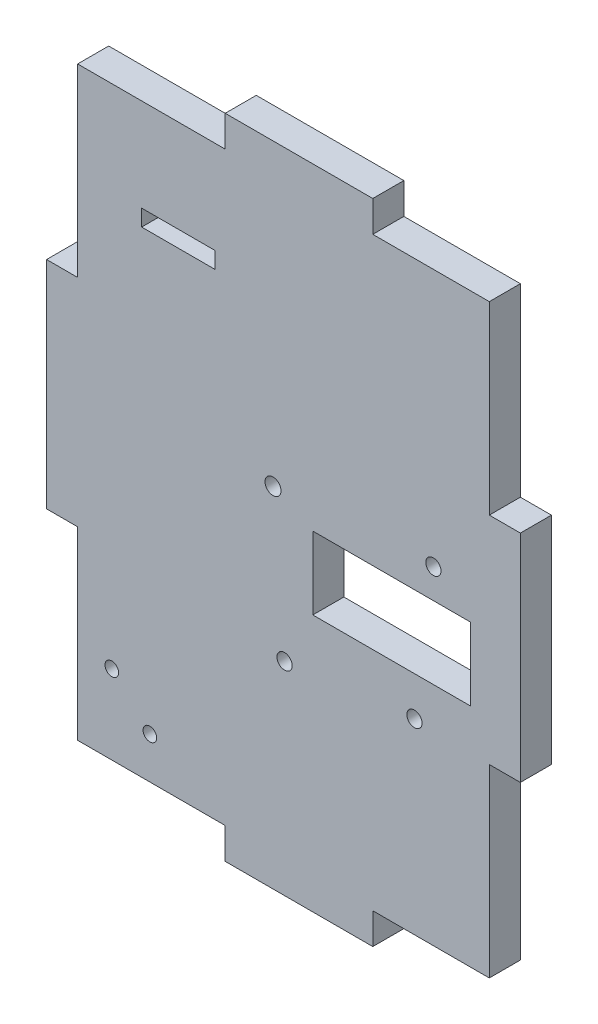
ISO-10303-21;
HEADER;
FILE_DESCRIPTION(('STEP AP214'),'2;1');
FILE_NAME('part.step','',(''),(''),'','','');
FILE_SCHEMA(('AUTOMOTIVE_DESIGN { 1 0 10303 214 1 1 1 1 }'));
ENDSEC;
DATA;
#1=APPLICATION_CONTEXT('core data for automotive mechanical design processes');
#2=APPLICATION_PROTOCOL_DEFINITION('international standard','automotive_design',2000,#1);
#3=PRODUCT_CONTEXT('',#1,'mechanical');
#4=PRODUCT('Part','Part','',(#3));
#5=PRODUCT_RELATED_PRODUCT_CATEGORY('part','',(#4));
#6=PRODUCT_DEFINITION_FORMATION('','',#4);
#7=PRODUCT_DEFINITION_CONTEXT('part definition',#1,'design');
#8=PRODUCT_DEFINITION('design','',#6,#7);
#9=PRODUCT_DEFINITION_SHAPE('','',#8);
#10=(LENGTH_UNIT() NAMED_UNIT(*) SI_UNIT(.MILLI.,.METRE.));
#11=(NAMED_UNIT(*) PLANE_ANGLE_UNIT() SI_UNIT($,.RADIAN.));
#12=(NAMED_UNIT(*) SI_UNIT($,.STERADIAN.) SOLID_ANGLE_UNIT());
#13=UNCERTAINTY_MEASURE_WITH_UNIT(LENGTH_MEASURE(1.E-05),#10,'distance_accuracy_value','');
#14=(GEOMETRIC_REPRESENTATION_CONTEXT(3) GLOBAL_UNCERTAINTY_ASSIGNED_CONTEXT((#13)) GLOBAL_UNIT_ASSIGNED_CONTEXT((#10,
#11,#12)) REPRESENTATION_CONTEXT('',''));
#15=CARTESIAN_POINT('',(0.,0.,0.));
#16=DIRECTION('',(0.,0.,1.));
#17=DIRECTION('',(1.,0.,0.));
#18=AXIS2_PLACEMENT_3D('',#15,#16,#17);
#19=CARTESIAN_POINT('',(0.,0.,5.7912));
#20=DIRECTION('',(0.,0.,-1.));
#21=DIRECTION('',(-1.,0.,0.));
#22=AXIS2_PLACEMENT_3D('',#19,#20,#21);
#23=PLANE('',#22);
#24=DIRECTION('',(1.,0.,0.));
#25=VECTOR('',#24,1.);
#26=CARTESIAN_POINT('',(-26.4395091638221,34.2389804626393,5.7912));
#27=LINE('',#26,#25);
#28=CARTESIAN_POINT('',(-26.4395091638221,34.2389804626393,5.7912));
#29=VERTEX_POINT('',#28);
#30=CARTESIAN_POINT('',(-12.7682869597336,34.2389804626393,5.7912));
#31=VERTEX_POINT('',#30);
#32=EDGE_CURVE('E231',#29,#31,#27,.T.);
#33=ORIENTED_EDGE('',*,*,#32,.F.);
#34=DIRECTION('',(0.,-1.,0.));
#35=VECTOR('',#34,1.);
#36=CARTESIAN_POINT('',(-26.4395091638221,34.2389804626393,5.7912));
#37=LINE('',#36,#35);
#38=CARTESIAN_POINT('',(-26.4395091638221,37.2992746155063,5.7912));
#39=VERTEX_POINT('',#38);
#40=EDGE_CURVE('E50',#39,#29,#37,.T.);
#41=ORIENTED_EDGE('',*,*,#40,.F.);
#42=DIRECTION('',(-1.,0.,0.));
#43=VECTOR('',#42,1.);
#44=CARTESIAN_POINT('',(-26.4395091638221,37.2992746155063,5.7912));
#45=LINE('',#44,#43);
#46=CARTESIAN_POINT('',(-12.7682869597336,37.2992746155063,5.7912));
#47=VERTEX_POINT('',#46);
#48=EDGE_CURVE('E237',#47,#39,#45,.T.);
#49=ORIENTED_EDGE('',*,*,#48,.F.);
#50=DIRECTION('',(0.,1.,0.));
#51=VECTOR('',#50,1.);
#52=CARTESIAN_POINT('',(-12.7682869597336,34.2389804626393,5.7912));
#53=LINE('',#52,#51);
#54=EDGE_CURVE('E222',#31,#47,#53,.T.);
#55=ORIENTED_EDGE('',*,*,#54,.F.);
#56=EDGE_LOOP('',(#33,#41,#49,#55));
#57=FACE_BOUND('',#56,.T.);
#58=CARTESIAN_POINT('',(-24.91218752969,-46.860591388321,5.7912));
#59=DIRECTION('',(0.,0.,-1.));
#60=DIRECTION('',(-1.,0.,0.));
#61=AXIS2_PLACEMENT_3D('',#58,#59,#60);
#62=CIRCLE('',#61,1.26999999999983);
#63=CARTESIAN_POINT('',(-26.1821875296899,-46.860591388321,5.7912));
#64=VERTEX_POINT('',#63);
#65=EDGE_CURVE('E251',#64,#64,#62,.F.);
#66=ORIENTED_EDGE('',*,*,#65,.F.);
#67=EDGE_LOOP('',(#66));
#68=FACE_BOUND('',#67,.T.);
#69=DIRECTION('',(0.,1.,0.));
#70=VECTOR('',#69,1.);
#71=CARTESIAN_POINT('',(-10.8627333333334,54.6099499999999,5.7912000000002));
#72=LINE('',#71,#70);
#73=CARTESIAN_POINT('',(-10.8627333333334,54.6099999999999,5.7912000000002));
#74=VERTEX_POINT('',#73);
#75=CARTESIAN_POINT('',(-10.8627333333334,60.4011999999999,5.7912000000002));
#76=VERTEX_POINT('',#75);
#77=EDGE_CURVE('E260',#74,#76,#72,.T.);
#78=ORIENTED_EDGE('',*,*,#77,.F.);
#79=DIRECTION('',(-1.,0.,0.));
#80=VECTOR('',#79,1.);
#81=CARTESIAN_POINT('',(0.,54.6099999999999,5.7912));
#82=LINE('',#81,#80);
#83=CARTESIAN_POINT('',(-38.3793999999997,54.6099999999999,5.79120000000019));
#84=VERTEX_POINT('',#83);
#85=EDGE_CURVE('E364',#74,#84,#82,.T.);
#86=ORIENTED_EDGE('',*,*,#85,.T.);
#87=DIRECTION('',(0.,1.,0.));
#88=VECTOR('',#87,1.);
#89=CARTESIAN_POINT('',(-38.3794,-60.4012,5.7912));
#90=LINE('',#89,#88);
#91=CARTESIAN_POINT('',(-38.3794000000001,20.1337333333334,5.79120000000013));
#92=VERTEX_POINT('',#91);
#93=EDGE_CURVE('E354',#92,#84,#90,.T.);
#94=ORIENTED_EDGE('',*,*,#93,.F.);
#95=DIRECTION('',(1.,0.,0.));
#96=VECTOR('',#95,1.);
#97=CARTESIAN_POINT('',(-44.1706000000001,20.1337333333333,5.79120000000013));
#98=LINE('',#97,#96);
#99=CARTESIAN_POINT('',(-44.1706000000001,20.1337333333333,5.79120000000013));
#100=VERTEX_POINT('',#99);
#101=EDGE_CURVE('E351',#100,#92,#98,.T.);
#102=ORIENTED_EDGE('',*,*,#101,.F.);
#103=DIRECTION('',(0.,-1.,0.));
#104=VECTOR('',#103,1.);
#105=CARTESIAN_POINT('',(-44.1706,-60.4012,5.7912));
#106=LINE('',#105,#104);
#107=CARTESIAN_POINT('',(-44.1706000000001,-20.1337333333333,5.79120000000007));
#108=VERTEX_POINT('',#107);
#109=EDGE_CURVE('E438',#100,#108,#106,.T.);
#110=ORIENTED_EDGE('',*,*,#109,.T.);
#111=DIRECTION('',(1.,0.,0.));
#112=VECTOR('',#111,1.);
#113=CARTESIAN_POINT('',(-44.1706000000001,-20.1337333333333,5.79120000000007));
#114=LINE('',#113,#112);
#115=CARTESIAN_POINT('',(-38.3794000000001,-20.1337333333333,5.79120000000007));
#116=VERTEX_POINT('',#115);
#117=EDGE_CURVE('E347',#108,#116,#114,.T.);
#118=ORIENTED_EDGE('',*,*,#117,.T.);
#119=CARTESIAN_POINT('',(-38.3794,-54.610000000001,5.79120000000001));
#120=VERTEX_POINT('',#119);
#121=EDGE_CURVE('E362',#120,#116,#90,.T.);
#122=ORIENTED_EDGE('',*,*,#121,.F.);
#123=DIRECTION('',(-1.,0.,0.));
#124=VECTOR('',#123,1.);
#125=CARTESIAN_POINT('',(0.,-54.6100000000001,5.7912));
#126=LINE('',#125,#124);
#127=CARTESIAN_POINT('',(-10.8627333333335,-54.6100000000001,5.79120000000177));
#128=VERTEX_POINT('',#127);
#129=EDGE_CURVE('E371',#128,#120,#126,.T.);
#130=ORIENTED_EDGE('',*,*,#129,.F.);
#131=DIRECTION('',(0.,1.,0.));
#132=VECTOR('',#131,1.);
#133=CARTESIAN_POINT('',(-10.8627333333335,-60.4012000000001,5.79120000000177));
#134=LINE('',#133,#132);
#135=CARTESIAN_POINT('',(-10.8627333333335,-60.4012000000001,5.79120000000177));
#136=VERTEX_POINT('',#135);
#137=EDGE_CURVE('E320',#136,#128,#134,.T.);
#138=ORIENTED_EDGE('',*,*,#137,.F.);
#139=DIRECTION('',(1.,0.,0.));
#140=VECTOR('',#139,1.);
#141=CARTESIAN_POINT('',(-44.1706,-60.4012,5.7912));
#142=LINE('',#141,#140);
#143=CARTESIAN_POINT('',(16.6539333333331,-60.4012000000001,5.79120000000174));
#144=VERTEX_POINT('',#143);
#145=EDGE_CURVE('E441',#136,#144,#142,.T.);
#146=ORIENTED_EDGE('',*,*,#145,.T.);
#147=DIRECTION('',(0.,1.,0.));
#148=VECTOR('',#147,1.);
#149=CARTESIAN_POINT('',(16.6539333333331,-60.4012000000001,5.79120000000174));
#150=LINE('',#149,#148);
#151=CARTESIAN_POINT('',(16.6539333333331,-54.6100000000001,5.79120000000175));
#152=VERTEX_POINT('',#151);
#153=EDGE_CURVE('E331',#144,#152,#150,.T.);
#154=ORIENTED_EDGE('',*,*,#153,.T.);
#155=CARTESIAN_POINT('',(38.3793999999998,-54.6100000000001,5.7912));
#156=VERTEX_POINT('',#155);
#157=EDGE_CURVE('E373',#156,#152,#126,.T.);
#158=ORIENTED_EDGE('',*,*,#157,.F.);
#159=DIRECTION('',(0.,-1.,0.));
#160=VECTOR('',#159,1.);
#161=CARTESIAN_POINT('',(38.3793999999999,0.,5.7912));
#162=LINE('',#161,#160);
#163=CARTESIAN_POINT('',(38.3793999999998,-20.1337333333336,5.7912));
#164=VERTEX_POINT('',#163);
#165=EDGE_CURVE('E368',#164,#156,#162,.T.);
#166=ORIENTED_EDGE('',*,*,#165,.F.);
#167=DIRECTION('',(1.,0.,0.));
#168=VECTOR('',#167,1.);
#169=CARTESIAN_POINT('',(38.3793999999998,-20.1337333333336,5.7912));
#170=LINE('',#169,#168);
#171=CARTESIAN_POINT('',(44.1705999999999,-20.1337333333336,5.7912));
#172=VERTEX_POINT('',#171);
#173=EDGE_CURVE('E299',#164,#172,#170,.T.);
#174=ORIENTED_EDGE('',*,*,#173,.T.);
#175=DIRECTION('',(0.,1.,0.));
#176=VECTOR('',#175,1.);
#177=CARTESIAN_POINT('',(44.1706,-60.4012,5.7912));
#178=LINE('',#177,#176);
#179=CARTESIAN_POINT('',(44.1705999999999,20.1337333333331,5.7912000000001));
#180=VERTEX_POINT('',#179);
#181=EDGE_CURVE('E431',#172,#180,#178,.T.);
#182=ORIENTED_EDGE('',*,*,#181,.T.);
#183=DIRECTION('',(1.,0.,0.));
#184=VECTOR('',#183,1.);
#185=CARTESIAN_POINT('',(38.3793999999998,20.1337333333331,5.7912000000001));
#186=LINE('',#185,#184);
#187=CARTESIAN_POINT('',(38.3793999999998,20.1337333333331,5.7912000000001));
#188=VERTEX_POINT('',#187);
#189=EDGE_CURVE('E302',#188,#180,#186,.T.);
#190=ORIENTED_EDGE('',*,*,#189,.F.);
#191=CARTESIAN_POINT('',(38.3793999999999,54.6099999999998,5.7912));
#192=VERTEX_POINT('',#191);
#193=EDGE_CURVE('E370',#192,#188,#162,.T.);
#194=ORIENTED_EDGE('',*,*,#193,.F.);
#195=CARTESIAN_POINT('',(16.6539333333333,54.6099999999999,5.7912000000002));
#196=VERTEX_POINT('',#195);
#197=EDGE_CURVE('E367',#192,#196,#82,.T.);
#198=ORIENTED_EDGE('',*,*,#197,.T.);
#199=DIRECTION('',(0.,1.,0.));
#200=VECTOR('',#199,1.);
#201=CARTESIAN_POINT('',(16.6539333333333,54.6099499999999,5.7912000000002));
#202=LINE('',#201,#200);
#203=CARTESIAN_POINT('',(16.6539333333333,60.4011999999999,5.7912000000002));
#204=VERTEX_POINT('',#203);
#205=EDGE_CURVE('E261',#196,#204,#202,.T.);
#206=ORIENTED_EDGE('',*,*,#205,.T.);
#207=DIRECTION('',(-1.,0.,0.));
#208=VECTOR('',#207,1.);
#209=CARTESIAN_POINT('',(-44.1706,60.4012,5.7912));
#210=LINE('',#209,#208);
#211=EDGE_CURVE('E434',#204,#76,#210,.T.);
#212=ORIENTED_EDGE('',*,*,#211,.T.);
#213=EDGE_LOOP('',(#78,#86,#94,#102,#110,#118,#122,#130,#138,#146,#154,#158,#166,#174,#182,#190,
#194,#198,#206,#212));
#214=FACE_BOUND('',#213,.T.);
#215=DIRECTION('',(-1.,0.,0.));
#216=VECTOR('',#215,1.);
#217=CARTESIAN_POINT('',(5.47144261334685,-12.4393642243081,5.7912));
#218=LINE('',#217,#216);
#219=CARTESIAN_POINT('',(34.8387940352524,-12.4393642243081,5.7912));
#220=VERTEX_POINT('',#219);
#221=CARTESIAN_POINT('',(5.47144261334685,-12.4393642243081,5.7912));
#222=VERTEX_POINT('',#221);
#223=EDGE_CURVE('E384',#220,#222,#218,.T.);
#224=ORIENTED_EDGE('',*,*,#223,.T.);
#225=DIRECTION('',(0.,1.,0.));
#226=VECTOR('',#225,1.);
#227=CARTESIAN_POINT('',(5.47144261334685,1.10549881980404,5.7912));
#228=LINE('',#227,#226);
#229=CARTESIAN_POINT('',(5.47144261334685,1.10549881980404,5.7912));
#230=VERTEX_POINT('',#229);
#231=EDGE_CURVE('E374',#222,#230,#228,.T.);
#232=ORIENTED_EDGE('',*,*,#231,.T.);
#233=DIRECTION('',(1.,0.,0.));
#234=VECTOR('',#233,1.);
#235=CARTESIAN_POINT('',(5.47144261334685,1.10549881980404,5.7912));
#236=LINE('',#235,#234);
#237=CARTESIAN_POINT('',(34.8387940352524,1.10549881980404,5.7912));
#238=VERTEX_POINT('',#237);
#239=EDGE_CURVE('E377',#230,#238,#236,.T.);
#240=ORIENTED_EDGE('',*,*,#239,.T.);
#241=DIRECTION('',(0.,-1.,0.));
#242=VECTOR('',#241,1.);
#243=CARTESIAN_POINT('',(34.8387940352524,1.10549881980404,5.7912));
#244=LINE('',#243,#242);
#245=EDGE_CURVE('E381',#238,#220,#244,.T.);
#246=ORIENTED_EDGE('',*,*,#245,.T.);
#247=EDGE_LOOP('',(#224,#232,#240,#246));
#248=FACE_BOUND('',#247,.T.);
#249=CARTESIAN_POINT('',(27.9536640877018,6.59881508488763,5.7912));
#250=DIRECTION('',(0.,0.,1.));
#251=DIRECTION('',(1.,0.,0.));
#252=AXIS2_PLACEMENT_3D('',#249,#250,#251);
#253=CIRCLE('',#252,1.4224);
#254=CARTESIAN_POINT('',(29.3760640877018,6.59881508488763,5.7912));
#255=VERTEX_POINT('',#254);
#256=EDGE_CURVE('E400',#255,#255,#253,.T.);
#257=ORIENTED_EDGE('',*,*,#256,.F.);
#258=EDGE_LOOP('',(#257));
#259=FACE_BOUND('',#258,.T.);
#260=CARTESIAN_POINT('',(-1.94945011690196,4.63092805129448,5.7912));
#261=DIRECTION('',(0.,0.,1.));
#262=DIRECTION('',(1.,0.,0.));
#263=AXIS2_PLACEMENT_3D('',#260,#261,#262);
#264=CIRCLE('',#263,1.49764105261563);
#265=CARTESIAN_POINT('',(-0.451809064286326,4.63092805129448,5.7912));
#266=VERTEX_POINT('',#265);
#267=EDGE_CURVE('E410',#266,#266,#264,.T.);
#268=ORIENTED_EDGE('',*,*,#267,.F.);
#269=EDGE_LOOP('',(#268));
#270=FACE_BOUND('',#269,.T.);
#271=CARTESIAN_POINT('',(24.4236958284387,-19.7446538690287,5.7912));
#272=DIRECTION('',(0.,0.,1.));
#273=DIRECTION('',(1.,0.,0.));
#274=AXIS2_PLACEMENT_3D('',#271,#272,#273);
#275=CIRCLE('',#274,1.4224);
#276=CARTESIAN_POINT('',(25.8460958284387,-19.7446538690287,5.7912));
#277=VERTEX_POINT('',#276);
#278=EDGE_CURVE('E416',#277,#277,#275,.T.);
#279=ORIENTED_EDGE('',*,*,#278,.F.);
#280=EDGE_LOOP('',(#279));
#281=FACE_BOUND('',#280,.T.);
#282=CARTESIAN_POINT('',(0.203199999999459,-22.5641942190248,5.7912));
#283=DIRECTION('',(0.,0.,1.));
#284=DIRECTION('',(1.,0.,0.));
#285=AXIS2_PLACEMENT_3D('',#282,#283,#284);
#286=CIRCLE('',#285,1.4224);
#287=CARTESIAN_POINT('',(1.62559999999946,-22.5641942190248,5.7912));
#288=VERTEX_POINT('',#287);
#289=EDGE_CURVE('E422',#288,#288,#286,.T.);
#290=ORIENTED_EDGE('',*,*,#289,.F.);
#291=EDGE_LOOP('',(#290));
#292=FACE_BOUND('',#291,.T.);
#293=CARTESIAN_POINT('',(-32.0098826167025,-39.8787828932964,5.7912));
#294=DIRECTION('',(0.,0.,-1.));
#295=DIRECTION('',(-1.,0.,0.));
#296=AXIS2_PLACEMENT_3D('',#293,#294,#295);
#297=CIRCLE('',#296,1.26999999999982);
#298=CARTESIAN_POINT('',(-33.2798826167023,-39.8787828932964,5.7912));
#299=VERTEX_POINT('',#298);
#300=EDGE_CURVE('E247',#299,#299,#297,.F.);
#301=ORIENTED_EDGE('',*,*,#300,.F.);
#302=EDGE_LOOP('',(#301));
#303=FACE_BOUND('',#302,.T.);
#304=ADVANCED_FACE('F35',(#57,#68,#214,#248,#259,#270,#281,#292,#303),#23,.F.);
#305=CARTESIAN_POINT('',(0.,0.,0.));
#306=DIRECTION('',(0.,0.,-1.));
#307=DIRECTION('',(-1.,0.,0.));
#308=AXIS2_PLACEMENT_3D('',#305,#306,#307);
#309=PLANE('',#308);
#310=DIRECTION('',(0.,1.,0.));
#311=VECTOR('',#310,1.);
#312=CARTESIAN_POINT('',(-26.4395091638221,0.,0.));
#313=LINE('',#312,#311);
#314=CARTESIAN_POINT('',(-26.4395091638221,34.2389804626393,0.));
#315=VERTEX_POINT('',#314);
#316=CARTESIAN_POINT('',(-26.4395091638221,37.2992746155063,0.));
#317=VERTEX_POINT('',#316);
#318=EDGE_CURVE('E11',#315,#317,#313,.T.);
#319=ORIENTED_EDGE('',*,*,#318,.F.);
#320=DIRECTION('',(-1.,0.,0.));
#321=VECTOR('',#320,1.);
#322=CARTESIAN_POINT('',(0.,34.2389804626393,0.));
#323=LINE('',#322,#321);
#324=CARTESIAN_POINT('',(-12.7682869597336,34.2389804626393,0.));
#325=VERTEX_POINT('',#324);
#326=EDGE_CURVE('E461',#325,#315,#323,.T.);
#327=ORIENTED_EDGE('',*,*,#326,.F.);
#328=DIRECTION('',(0.,-1.,0.));
#329=VECTOR('',#328,1.);
#330=CARTESIAN_POINT('',(-12.7682869597336,0.,0.));
#331=LINE('',#330,#329);
#332=CARTESIAN_POINT('',(-12.7682869597336,37.2992746155063,0.));
#333=VERTEX_POINT('',#332);
#334=EDGE_CURVE('E225',#333,#325,#331,.T.);
#335=ORIENTED_EDGE('',*,*,#334,.F.);
#336=DIRECTION('',(1.,0.,0.));
#337=VECTOR('',#336,1.);
#338=CARTESIAN_POINT('',(0.,37.2992746155063,0.));
#339=LINE('',#338,#337);
#340=EDGE_CURVE('E43',#317,#333,#339,.T.);
#341=ORIENTED_EDGE('',*,*,#340,.F.);
#342=EDGE_LOOP('',(#319,#327,#335,#341));
#343=FACE_BOUND('',#342,.T.);
#344=CARTESIAN_POINT('',(-24.91218752969,-46.860591388321,0.));
#345=DIRECTION('',(0.,0.,-1.));
#346=DIRECTION('',(-1.,0.,0.));
#347=AXIS2_PLACEMENT_3D('',#344,#345,#346);
#348=CIRCLE('',#347,1.26999999999983);
#349=CARTESIAN_POINT('',(-26.1821875296899,-46.860591388321,0.));
#350=VERTEX_POINT('',#349);
#351=EDGE_CURVE('E250',#350,#350,#348,.F.);
#352=ORIENTED_EDGE('',*,*,#351,.T.);
#353=EDGE_LOOP('',(#352));
#354=FACE_BOUND('',#353,.T.);
#355=DIRECTION('',(1.,0.,0.));
#356=VECTOR('',#355,1.);
#357=CARTESIAN_POINT('',(-44.1706000000001,20.1337333333334,1.33573707650214E-13));
#358=LINE('',#357,#356);
#359=CARTESIAN_POINT('',(-44.1706000000001,20.1337333333334,1.33573707650214E-13));
#360=VERTEX_POINT('',#359);
#361=CARTESIAN_POINT('',(-38.3794000000001,20.1337333333334,1.31838984174237E-13));
#362=VERTEX_POINT('',#361);
#363=EDGE_CURVE('E355',#360,#362,#358,.T.);
#364=ORIENTED_EDGE('',*,*,#363,.T.);
#365=DIRECTION('',(0.,1.,0.));
#366=VECTOR('',#365,1.);
#367=CARTESIAN_POINT('',(-38.3794000000001,0.,0.));
#368=LINE('',#367,#366);
#369=CARTESIAN_POINT('',(-38.3794000000002,54.6099999999999,2.13159420670017E-13));
#370=VERTEX_POINT('',#369);
#371=EDGE_CURVE('E458',#362,#370,#368,.T.);
#372=ORIENTED_EDGE('',*,*,#371,.T.);
#373=DIRECTION('',(-1.,0.,0.));
#374=VECTOR('',#373,1.);
#375=CARTESIAN_POINT('',(44.1705999999999,54.6099999999999,2.0122792321331E-13));
#376=LINE('',#375,#374);
#377=CARTESIAN_POINT('',(-10.8627333333334,54.6099999999999,2.0122792321331E-13));
#378=VERTEX_POINT('',#377);
#379=EDGE_CURVE('E269',#378,#370,#376,.T.);
#380=ORIENTED_EDGE('',*,*,#379,.F.);
#381=DIRECTION('',(0.,1.,0.));
#382=VECTOR('',#381,1.);
#383=CARTESIAN_POINT('',(-10.8627333333334,54.6099999999999,2.08166817117217E-13));
#384=LINE('',#383,#382);
#385=CARTESIAN_POINT('',(-10.8627333333334,60.4012,0.));
#386=VERTEX_POINT('',#385);
#387=EDGE_CURVE('E531',#378,#386,#384,.T.);
#388=ORIENTED_EDGE('',*,*,#387,.T.);
#389=DIRECTION('',(-1.,0.,0.));
#390=VECTOR('',#389,1.);
#391=CARTESIAN_POINT('',(-44.1706,60.4012,0.));
#392=LINE('',#391,#390);
#393=CARTESIAN_POINT('',(16.6539333333333,60.4011999999999,2.15105711021124E-13));
#394=VERTEX_POINT('',#393);
#395=EDGE_CURVE('E447',#394,#386,#392,.T.);
#396=ORIENTED_EDGE('',*,*,#395,.F.);
#397=DIRECTION('',(0.,-1.,0.));
#398=VECTOR('',#397,1.);
#399=CARTESIAN_POINT('',(16.6539333333333,54.6099999999999,2.08166817117217E-13));
#400=LINE('',#399,#398);
#401=CARTESIAN_POINT('',(16.6539333333333,54.6099999999999,0.));
#402=VERTEX_POINT('',#401);
#403=EDGE_CURVE('E279',#394,#402,#400,.T.);
#404=ORIENTED_EDGE('',*,*,#403,.T.);
#405=CARTESIAN_POINT('',(38.3793999999999,54.6099999999998,1.87350135405495E-13));
#406=VERTEX_POINT('',#405);
#407=EDGE_CURVE('E275',#406,#402,#376,.T.);
#408=ORIENTED_EDGE('',*,*,#407,.F.);
#409=DIRECTION('',(0.,-1.,0.));
#410=VECTOR('',#409,1.);
#411=CARTESIAN_POINT('',(38.3793999999998,-60.4012000000002,0.));
#412=LINE('',#411,#410);
#413=CARTESIAN_POINT('',(38.3793999999998,20.1337333333331,1.04083408558608E-13));
#414=VERTEX_POINT('',#413);
#415=EDGE_CURVE('E308',#406,#414,#412,.T.);
#416=ORIENTED_EDGE('',*,*,#415,.T.);
#417=DIRECTION('',(1.,0.,0.));
#418=VECTOR('',#417,1.);
#419=CARTESIAN_POINT('',(38.3793999999998,20.1337333333331,1.04083408558608E-13));
#420=LINE('',#419,#418);
#421=CARTESIAN_POINT('',(44.1705999999999,20.1337333333331,1.04083408558608E-13));
#422=VERTEX_POINT('',#421);
#423=EDGE_CURVE('E289',#414,#422,#420,.T.);
#424=ORIENTED_EDGE('',*,*,#423,.T.);
#425=DIRECTION('',(0.,1.,0.));
#426=VECTOR('',#425,1.);
#427=CARTESIAN_POINT('',(44.1706,-60.4012,0.));
#428=LINE('',#427,#426);
#429=CARTESIAN_POINT('',(44.1705999999999,-20.1337333333336,0.));
#430=VERTEX_POINT('',#429);
#431=EDGE_CURVE('E428',#430,#422,#428,.T.);
#432=ORIENTED_EDGE('',*,*,#431,.F.);
#433=DIRECTION('',(1.,0.,0.));
#434=VECTOR('',#433,1.);
#435=CARTESIAN_POINT('',(38.3793999999998,-20.1337333333336,0.));
#436=LINE('',#435,#434);
#437=CARTESIAN_POINT('',(38.3793999999998,-20.1337333333336,0.));
#438=VERTEX_POINT('',#437);
#439=EDGE_CURVE('E296',#438,#430,#436,.T.);
#440=ORIENTED_EDGE('',*,*,#439,.F.);
#441=CARTESIAN_POINT('',(38.3793999999998,-54.6100000000001,1.73859034177873E-12));
#442=VERTEX_POINT('',#441);
#443=EDGE_CURVE('E307',#438,#442,#412,.T.);
#444=ORIENTED_EDGE('',*,*,#443,.T.);
#445=DIRECTION('',(-1.,0.,0.));
#446=VECTOR('',#445,1.);
#447=CARTESIAN_POINT('',(44.1705999999998,-54.6100000000001,1.73472347597681E-12));
#448=LINE('',#447,#446);
#449=CARTESIAN_POINT('',(16.6539333333331,-54.6100000000001,1.75554015768853E-12));
#450=VERTEX_POINT('',#449);
#451=EDGE_CURVE('E335',#442,#450,#448,.T.);
#452=ORIENTED_EDGE('',*,*,#451,.T.);
#453=DIRECTION('',(0.,1.,0.));
#454=VECTOR('',#453,1.);
#455=CARTESIAN_POINT('',(16.6539333333331,-60.4012000000001,1.74166236988071E-12));
#456=LINE('',#455,#454);
#457=CARTESIAN_POINT('',(16.6539333333331,-60.4012000000001,1.74166236988071E-12));
#458=VERTEX_POINT('',#457);
#459=EDGE_CURVE('E328',#458,#450,#456,.T.);
#460=ORIENTED_EDGE('',*,*,#459,.F.);
#461=DIRECTION('',(1.,0.,0.));
#462=VECTOR('',#461,1.);
#463=CARTESIAN_POINT('',(-44.1706,-60.4012,0.));
#464=LINE('',#463,#462);
#465=CARTESIAN_POINT('',(-10.8627333333335,-60.4012000000001,1.76941794549634E-12));
#466=VERTEX_POINT('',#465);
#467=EDGE_CURVE('E435',#466,#458,#464,.T.);
#468=ORIENTED_EDGE('',*,*,#467,.F.);
#469=DIRECTION('',(0.,1.,0.));
#470=VECTOR('',#469,1.);
#471=CARTESIAN_POINT('',(-10.8627333333335,-60.4012000000001,1.76941794549634E-12));
#472=LINE('',#471,#470);
#473=CARTESIAN_POINT('',(-10.8627333333335,-54.6100000000001,0.));
#474=VERTEX_POINT('',#473);
#475=EDGE_CURVE('E324',#466,#474,#472,.T.);
#476=ORIENTED_EDGE('',*,*,#475,.T.);
#477=CARTESIAN_POINT('',(-38.3794,-54.610000000001,1.78676518025611E-12));
#478=VERTEX_POINT('',#477);
#479=EDGE_CURVE('E327',#474,#478,#448,.T.);
#480=ORIENTED_EDGE('',*,*,#479,.T.);
#481=CARTESIAN_POINT('',(-38.3794000000001,-20.1337333333333,0.));
#482=VERTEX_POINT('',#481);
#483=EDGE_CURVE('E444',#478,#482,#368,.T.);
#484=ORIENTED_EDGE('',*,*,#483,.T.);
#485=DIRECTION('',(1.,0.,0.));
#486=VECTOR('',#485,1.);
#487=CARTESIAN_POINT('',(-44.1706000000001,-20.1337333333333,0.));
#488=LINE('',#487,#486);
#489=CARTESIAN_POINT('',(-44.1706000000001,-20.1337333333333,0.));
#490=VERTEX_POINT('',#489);
#491=EDGE_CURVE('E358',#490,#482,#488,.T.);
#492=ORIENTED_EDGE('',*,*,#491,.F.);
#493=DIRECTION('',(0.,-1.,0.));
#494=VECTOR('',#493,1.);
#495=CARTESIAN_POINT('',(-44.1706,-60.4012,0.));
#496=LINE('',#495,#494);
#497=EDGE_CURVE('E450',#360,#490,#496,.T.);
#498=ORIENTED_EDGE('',*,*,#497,.F.);
#499=EDGE_LOOP('',(#364,#372,#380,#388,#396,#404,#408,#416,#424,#432,#440,#444,#452,#460,#468,
#476,#480,#484,#492,#498));
#500=FACE_BOUND('',#499,.T.);
#501=CARTESIAN_POINT('',(0.203199999999459,-22.5641942190248,0.));
#502=DIRECTION('',(0.,0.,1.));
#503=DIRECTION('',(1.,0.,0.));
#504=AXIS2_PLACEMENT_3D('',#501,#502,#503);
#505=CIRCLE('',#504,1.4224);
#506=CARTESIAN_POINT('',(1.62559999999946,-22.5641942190248,0.));
#507=VERTEX_POINT('',#506);
#508=EDGE_CURVE('E425',#507,#507,#505,.T.);
#509=ORIENTED_EDGE('',*,*,#508,.T.);
#510=EDGE_LOOP('',(#509));
#511=FACE_BOUND('',#510,.T.);
#512=CARTESIAN_POINT('',(24.4236958284387,-19.7446538690287,0.));
#513=DIRECTION('',(0.,0.,1.));
#514=DIRECTION('',(1.,0.,0.));
#515=AXIS2_PLACEMENT_3D('',#512,#513,#514);
#516=CIRCLE('',#515,1.4224);
#517=CARTESIAN_POINT('',(25.8460958284387,-19.7446538690287,0.));
#518=VERTEX_POINT('',#517);
#519=EDGE_CURVE('E419',#518,#518,#516,.T.);
#520=ORIENTED_EDGE('',*,*,#519,.T.);
#521=EDGE_LOOP('',(#520));
#522=FACE_BOUND('',#521,.T.);
#523=CARTESIAN_POINT('',(-1.94945011690196,4.63092805129448,0.));
#524=DIRECTION('',(0.,0.,1.));
#525=DIRECTION('',(1.,0.,0.));
#526=AXIS2_PLACEMENT_3D('',#523,#524,#525);
#527=CIRCLE('',#526,1.49764105261563);
#528=CARTESIAN_POINT('',(-0.451809064286326,4.63092805129448,0.));
#529=VERTEX_POINT('',#528);
#530=EDGE_CURVE('E413',#529,#529,#527,.T.);
#531=ORIENTED_EDGE('',*,*,#530,.T.);
#532=EDGE_LOOP('',(#531));
#533=FACE_BOUND('',#532,.T.);
#534=CARTESIAN_POINT('',(27.9536640877018,6.59881508488763,0.));
#535=DIRECTION('',(0.,0.,1.));
#536=DIRECTION('',(1.,0.,0.));
#537=AXIS2_PLACEMENT_3D('',#534,#535,#536);
#538=CIRCLE('',#537,1.4224);
#539=CARTESIAN_POINT('',(29.3760640877018,6.59881508488763,0.));
#540=VERTEX_POINT('',#539);
#541=EDGE_CURVE('E407',#540,#540,#538,.T.);
#542=ORIENTED_EDGE('',*,*,#541,.T.);
#543=EDGE_LOOP('',(#542));
#544=FACE_BOUND('',#543,.T.);
#545=DIRECTION('',(0.,1.,0.));
#546=VECTOR('',#545,1.);
#547=CARTESIAN_POINT('',(5.47144261334685,1.10549881980404,0.));
#548=LINE('',#547,#546);
#549=CARTESIAN_POINT('',(5.47144261334685,-12.4393642243081,0.));
#550=VERTEX_POINT('',#549);
#551=CARTESIAN_POINT('',(5.47144261334685,1.10549881980404,0.));
#552=VERTEX_POINT('',#551);
#553=EDGE_CURVE('E388',#550,#552,#548,.T.);
#554=ORIENTED_EDGE('',*,*,#553,.F.);
#555=DIRECTION('',(-1.,0.,0.));
#556=VECTOR('',#555,1.);
#557=CARTESIAN_POINT('',(5.47144261334685,-12.4393642243081,0.));
#558=LINE('',#557,#556);
#559=CARTESIAN_POINT('',(34.8387940352524,-12.4393642243081,0.));
#560=VERTEX_POINT('',#559);
#561=EDGE_CURVE('E378',#560,#550,#558,.T.);
#562=ORIENTED_EDGE('',*,*,#561,.F.);
#563=DIRECTION('',(0.,-1.,0.));
#564=VECTOR('',#563,1.);
#565=CARTESIAN_POINT('',(34.8387940352524,1.10549881980404,0.));
#566=LINE('',#565,#564);
#567=CARTESIAN_POINT('',(34.8387940352524,1.10549881980404,0.));
#568=VERTEX_POINT('',#567);
#569=EDGE_CURVE('E393',#568,#560,#566,.T.);
#570=ORIENTED_EDGE('',*,*,#569,.F.);
#571=DIRECTION('',(1.,0.,0.));
#572=VECTOR('',#571,1.);
#573=CARTESIAN_POINT('',(5.47144261334685,1.10549881980404,0.));
#574=LINE('',#573,#572);
#575=EDGE_CURVE('E390',#552,#568,#574,.T.);
#576=ORIENTED_EDGE('',*,*,#575,.F.);
#577=EDGE_LOOP('',(#554,#562,#570,#576));
#578=FACE_BOUND('',#577,.T.);
#579=CARTESIAN_POINT('',(-32.0098826167025,-39.8787828932964,0.));
#580=DIRECTION('',(0.,0.,-1.));
#581=DIRECTION('',(-1.,0.,0.));
#582=AXIS2_PLACEMENT_3D('',#579,#580,#581);
#583=CIRCLE('',#582,1.26999999999982);
#584=CARTESIAN_POINT('',(-33.2798826167023,-39.8787828932964,0.));
#585=VERTEX_POINT('',#584);
#586=EDGE_CURVE('E244',#585,#585,#583,.F.);
#587=ORIENTED_EDGE('',*,*,#586,.T.);
#588=EDGE_LOOP('',(#587));
#589=FACE_BOUND('',#588,.T.);
#590=ADVANCED_FACE('F473',(#343,#354,#500,#511,#522,#533,#544,#578,#589),#309,.T.);
#591=CARTESIAN_POINT('',(44.1706,-60.4012,5.7912));
#592=DIRECTION('',(-1.,0.,0.));
#593=DIRECTION('',(0.,0.,1.));
#594=AXIS2_PLACEMENT_3D('',#591,#592,#593);
#595=PLANE('',#594);
#596=DIRECTION('',(0.,0.,-1.));
#597=VECTOR('',#596,1.);
#598=CARTESIAN_POINT('',(44.1705999999999,-20.1337333333336,0.));
#599=LINE('',#598,#597);
#600=EDGE_CURVE('E286',#172,#430,#599,.T.);
#601=ORIENTED_EDGE('',*,*,#600,.T.);
#602=ORIENTED_EDGE('',*,*,#431,.T.);
#603=DIRECTION('',(0.,0.,1.));
#604=VECTOR('',#603,1.);
#605=CARTESIAN_POINT('',(44.1705999999999,20.1337333333331,1.04083408558608E-13));
#606=LINE('',#605,#604);
#607=EDGE_CURVE('E290',#422,#180,#606,.T.);
#608=ORIENTED_EDGE('',*,*,#607,.T.);
#609=ORIENTED_EDGE('',*,*,#181,.F.);
#610=EDGE_LOOP('',(#601,#602,#608,#609));
#611=FACE_BOUND('',#610,.T.);
#612=ADVANCED_FACE('F37',(#611),#595,.F.);
#613=CARTESIAN_POINT('',(-44.1706,60.4012,5.7912));
#614=DIRECTION('',(0.,-1.,0.));
#615=DIRECTION('',(0.,0.,-1.));
#616=AXIS2_PLACEMENT_3D('',#613,#614,#615);
#617=PLANE('',#616);
#618=DIRECTION('',(0.,0.,1.));
#619=VECTOR('',#618,1.);
#620=CARTESIAN_POINT('',(-10.8627333333334,60.4011999999999,2.08166817117217E-13));
#621=LINE('',#620,#619);
#622=EDGE_CURVE('E254',#386,#76,#621,.T.);
#623=ORIENTED_EDGE('',*,*,#622,.T.);
#624=ORIENTED_EDGE('',*,*,#211,.F.);
#625=DIRECTION('',(0.,0.,-1.));
#626=VECTOR('',#625,1.);
#627=CARTESIAN_POINT('',(16.6539333333333,60.4011999999999,2.15105711021124E-13));
#628=LINE('',#627,#626);
#629=EDGE_CURVE('E257',#204,#394,#628,.T.);
#630=ORIENTED_EDGE('',*,*,#629,.T.);
#631=ORIENTED_EDGE('',*,*,#395,.T.);
#632=EDGE_LOOP('',(#623,#624,#630,#631));
#633=FACE_BOUND('',#632,.T.);
#634=ADVANCED_FACE('F505',(#633),#617,.F.);
#635=CARTESIAN_POINT('',(-44.1706,-60.4012,5.7912));
#636=DIRECTION('',(1.,0.,0.));
#637=DIRECTION('',(0.,0.,-1.));
#638=AXIS2_PLACEMENT_3D('',#635,#636,#637);
#639=PLANE('',#638);
#640=DIRECTION('',(0.,0.,1.));
#641=VECTOR('',#640,1.);
#642=CARTESIAN_POINT('',(-44.1706000000001,20.1337333333333,5.79120000000013));
#643=LINE('',#642,#641);
#644=EDGE_CURVE('E344',#360,#100,#643,.T.);
#645=ORIENTED_EDGE('',*,*,#644,.F.);
#646=ORIENTED_EDGE('',*,*,#497,.T.);
#647=DIRECTION('',(0.,0.,-1.));
#648=VECTOR('',#647,1.);
#649=CARTESIAN_POINT('',(-44.1706000000001,-20.1337333333333,5.79120000000007));
#650=LINE('',#649,#648);
#651=EDGE_CURVE('E342',#108,#490,#650,.T.);
#652=ORIENTED_EDGE('',*,*,#651,.F.);
#653=ORIENTED_EDGE('',*,*,#109,.F.);
#654=EDGE_LOOP('',(#645,#646,#652,#653));
#655=FACE_BOUND('',#654,.T.);
#656=ADVANCED_FACE('F502',(#655),#639,.F.);
#657=CARTESIAN_POINT('',(-44.1706,-60.4012,5.7912));
#658=DIRECTION('',(0.,1.,0.));
#659=DIRECTION('',(0.,0.,1.));
#660=AXIS2_PLACEMENT_3D('',#657,#658,#659);
#661=PLANE('',#660);
#662=DIRECTION('',(0.,0.,1.));
#663=VECTOR('',#662,1.);
#664=CARTESIAN_POINT('',(-10.8627333333335,-60.4012000000001,1.76941794549634E-12));
#665=LINE('',#664,#663);
#666=EDGE_CURVE('E315',#466,#136,#665,.T.);
#667=ORIENTED_EDGE('',*,*,#666,.F.);
#668=ORIENTED_EDGE('',*,*,#467,.T.);
#669=DIRECTION('',(0.,0.,-1.));
#670=VECTOR('',#669,1.);
#671=CARTESIAN_POINT('',(16.6539333333331,-60.4012000000001,1.74166236988071E-12));
#672=LINE('',#671,#670);
#673=EDGE_CURVE('E317',#144,#458,#672,.T.);
#674=ORIENTED_EDGE('',*,*,#673,.F.);
#675=ORIENTED_EDGE('',*,*,#145,.F.);
#676=EDGE_LOOP('',(#667,#668,#674,#675));
#677=FACE_BOUND('',#676,.T.);
#678=ADVANCED_FACE('F499',(#677),#661,.F.);
#679=CARTESIAN_POINT('',(0.203199999999459,-22.5641942190248,0.));
#680=DIRECTION('',(0.,0.,1.));
#681=DIRECTION('',(1.,0.,0.));
#682=AXIS2_PLACEMENT_3D('',#679,#680,#681);
#683=CYLINDRICAL_SURFACE('',#682,1.4224);
#684=ORIENTED_EDGE('',*,*,#508,.F.);
#685=EDGE_LOOP('',(#684));
#686=FACE_BOUND('',#685,.T.);
#687=ORIENTED_EDGE('',*,*,#289,.T.);
#688=EDGE_LOOP('',(#687));
#689=FACE_BOUND('',#688,.T.);
#690=ADVANCED_FACE('F496',(#686,#689),#683,.F.);
#691=CARTESIAN_POINT('',(24.4236958284387,-19.7446538690287,0.));
#692=DIRECTION('',(0.,0.,1.));
#693=DIRECTION('',(1.,0.,0.));
#694=AXIS2_PLACEMENT_3D('',#691,#692,#693);
#695=CYLINDRICAL_SURFACE('',#694,1.4224);
#696=ORIENTED_EDGE('',*,*,#519,.F.);
#697=EDGE_LOOP('',(#696));
#698=FACE_BOUND('',#697,.T.);
#699=ORIENTED_EDGE('',*,*,#278,.T.);
#700=EDGE_LOOP('',(#699));
#701=FACE_BOUND('',#700,.T.);
#702=ADVANCED_FACE('F621',(#698,#701),#695,.F.);
#703=CARTESIAN_POINT('',(-1.94945011690196,4.63092805129448,0.));
#704=DIRECTION('',(0.,0.,1.));
#705=DIRECTION('',(1.,0.,0.));
#706=AXIS2_PLACEMENT_3D('',#703,#704,#705);
#707=CYLINDRICAL_SURFACE('',#706,1.49764105261563);
#708=ORIENTED_EDGE('',*,*,#530,.F.);
#709=EDGE_LOOP('',(#708));
#710=FACE_BOUND('',#709,.T.);
#711=ORIENTED_EDGE('',*,*,#267,.T.);
#712=EDGE_LOOP('',(#711));
#713=FACE_BOUND('',#712,.T.);
#714=ADVANCED_FACE('F618',(#710,#713),#707,.F.);
#715=CARTESIAN_POINT('',(27.9536640877018,6.59881508488763,0.));
#716=DIRECTION('',(0.,0.,1.));
#717=DIRECTION('',(1.,0.,0.));
#718=AXIS2_PLACEMENT_3D('',#715,#716,#717);
#719=CYLINDRICAL_SURFACE('',#718,1.4224);
#720=ORIENTED_EDGE('',*,*,#541,.F.);
#721=EDGE_LOOP('',(#720));
#722=FACE_BOUND('',#721,.T.);
#723=ORIENTED_EDGE('',*,*,#256,.T.);
#724=EDGE_LOOP('',(#723));
#725=FACE_BOUND('',#724,.T.);
#726=ADVANCED_FACE('F614',(#722,#725),#719,.F.);
#727=CARTESIAN_POINT('',(5.47144261334685,1.10549881980404,5.7912));
#728=DIRECTION('',(-1.,0.,0.));
#729=DIRECTION('',(0.,-1.,0.));
#730=AXIS2_PLACEMENT_3D('',#727,#728,#729);
#731=PLANE('',#730);
#732=ORIENTED_EDGE('',*,*,#553,.T.);
#733=DIRECTION('',(0.,0.,-1.));
#734=VECTOR('',#733,1.);
#735=CARTESIAN_POINT('',(5.47144261334685,1.10549881980404,5.7912));
#736=LINE('',#735,#734);
#737=EDGE_CURVE('E387',#230,#552,#736,.T.);
#738=ORIENTED_EDGE('',*,*,#737,.F.);
#739=ORIENTED_EDGE('',*,*,#231,.F.);
#740=DIRECTION('',(0.,0.,-1.));
#741=VECTOR('',#740,1.);
#742=CARTESIAN_POINT('',(5.47144261334685,-12.4393642243081,5.7912));
#743=LINE('',#742,#741);
#744=EDGE_CURVE('E398',#222,#550,#743,.T.);
#745=ORIENTED_EDGE('',*,*,#744,.T.);
#746=EDGE_LOOP('',(#732,#738,#739,#745));
#747=FACE_BOUND('',#746,.T.);
#748=ADVANCED_FACE('F604',(#747),#731,.F.);
#749=CARTESIAN_POINT('',(5.47144261334685,-12.4393642243081,5.7912));
#750=DIRECTION('',(0.,-1.,0.));
#751=DIRECTION('',(0.,0.,-1.));
#752=AXIS2_PLACEMENT_3D('',#749,#750,#751);
#753=PLANE('',#752);
#754=ORIENTED_EDGE('',*,*,#561,.T.);
#755=ORIENTED_EDGE('',*,*,#744,.F.);
#756=ORIENTED_EDGE('',*,*,#223,.F.);
#757=DIRECTION('',(0.,0.,-1.));
#758=VECTOR('',#757,1.);
#759=CARTESIAN_POINT('',(34.8387940352524,-12.4393642243081,5.7912));
#760=LINE('',#759,#758);
#761=EDGE_CURVE('E401',#220,#560,#760,.T.);
#762=ORIENTED_EDGE('',*,*,#761,.T.);
#763=EDGE_LOOP('',(#754,#755,#756,#762));
#764=FACE_BOUND('',#763,.T.);
#765=ADVANCED_FACE('F600',(#764),#753,.F.);
#766=CARTESIAN_POINT('',(34.8387940352524,1.10549881980404,5.7912));
#767=DIRECTION('',(1.,0.,0.));
#768=DIRECTION('',(0.,0.,-1.));
#769=AXIS2_PLACEMENT_3D('',#766,#767,#768);
#770=PLANE('',#769);
#771=ORIENTED_EDGE('',*,*,#569,.T.);
#772=ORIENTED_EDGE('',*,*,#761,.F.);
#773=ORIENTED_EDGE('',*,*,#245,.F.);
#774=DIRECTION('',(0.,0.,-1.));
#775=VECTOR('',#774,1.);
#776=CARTESIAN_POINT('',(34.8387940352524,1.10549881980404,5.7912));
#777=LINE('',#776,#775);
#778=EDGE_CURVE('E403',#238,#568,#777,.T.);
#779=ORIENTED_EDGE('',*,*,#778,.T.);
#780=EDGE_LOOP('',(#771,#772,#773,#779));
#781=FACE_BOUND('',#780,.T.);
#782=ADVANCED_FACE('F603',(#781),#770,.F.);
#783=CARTESIAN_POINT('',(5.47144261334685,1.10549881980404,5.7912));
#784=DIRECTION('',(0.,1.,0.));
#785=DIRECTION('',(0.,0.,1.));
#786=AXIS2_PLACEMENT_3D('',#783,#784,#785);
#787=PLANE('',#786);
#788=ORIENTED_EDGE('',*,*,#575,.T.);
#789=ORIENTED_EDGE('',*,*,#778,.F.);
#790=ORIENTED_EDGE('',*,*,#239,.F.);
#791=ORIENTED_EDGE('',*,*,#737,.T.);
#792=EDGE_LOOP('',(#788,#789,#790,#791));
#793=FACE_BOUND('',#792,.T.);
#794=ADVANCED_FACE('F576',(#793),#787,.F.);
#795=CARTESIAN_POINT('',(38.3793999999998,20.1337333333331,1.04083408558608E-13));
#796=DIRECTION('',(0.,1.,0.));
#797=DIRECTION('',(-1.,0.,0.));
#798=AXIS2_PLACEMENT_3D('',#795,#796,#797);
#799=PLANE('',#798);
#800=ORIENTED_EDGE('',*,*,#607,.F.);
#801=ORIENTED_EDGE('',*,*,#423,.F.);
#802=DIRECTION('',(0.,0.,1.));
#803=VECTOR('',#802,1.);
#804=CARTESIAN_POINT('',(38.3793999999998,20.1337333333331,1.04083408558608E-13));
#805=LINE('',#804,#803);
#806=EDGE_CURVE('E282',#414,#188,#805,.T.);
#807=ORIENTED_EDGE('',*,*,#806,.T.);
#808=ORIENTED_EDGE('',*,*,#189,.T.);
#809=EDGE_LOOP('',(#800,#801,#807,#808));
#810=FACE_BOUND('',#809,.T.);
#811=ADVANCED_FACE('F574',(#810),#799,.T.);
#812=CARTESIAN_POINT('',(16.6539333333333,54.6099499999999,2.08166817117217E-13));
#813=DIRECTION('',(1.,0.,0.));
#814=DIRECTION('',(0.,1.,0.));
#815=AXIS2_PLACEMENT_3D('',#812,#813,#814);
#816=PLANE('',#815);
#817=DIRECTION('',(0.,0.,1.));
#818=VECTOR('',#817,1.);
#819=CARTESIAN_POINT('',(16.6539333333333,54.6099999999999,41.1480000000002));
#820=LINE('',#819,#818);
#821=EDGE_CURVE('E264',#402,#196,#820,.T.);
#822=ORIENTED_EDGE('',*,*,#821,.F.);
#823=ORIENTED_EDGE('',*,*,#403,.F.);
#824=ORIENTED_EDGE('',*,*,#629,.F.);
#825=ORIENTED_EDGE('',*,*,#205,.F.);
#826=EDGE_LOOP('',(#822,#823,#824,#825));
#827=FACE_BOUND('',#826,.T.);
#828=ADVANCED_FACE('F525',(#827),#816,.T.);
#829=CARTESIAN_POINT('',(-80.3656,54.6099999999999,41.1480000000002));
#830=DIRECTION('',(0.,-1.,0.));
#831=DIRECTION('',(0.,0.,-1.));
#832=AXIS2_PLACEMENT_3D('',#829,#830,#831);
#833=PLANE('',#832);
#834=DIRECTION('',(0.,0.,-1.));
#835=VECTOR('',#834,1.);
#836=CARTESIAN_POINT('',(38.3793999999999,54.6099999999998,1.87350135405495E-13));
#837=LINE('',#836,#835);
#838=EDGE_CURVE('E298',#192,#406,#837,.T.);
#839=ORIENTED_EDGE('',*,*,#838,.T.);
#840=ORIENTED_EDGE('',*,*,#407,.T.);
#841=ORIENTED_EDGE('',*,*,#821,.T.);
#842=ORIENTED_EDGE('',*,*,#197,.F.);
#843=EDGE_LOOP('',(#839,#840,#841,#842));
#844=FACE_BOUND('',#843,.T.);
#845=ADVANCED_FACE('F560',(#844),#833,.F.);
#846=CARTESIAN_POINT('',(38.3793999999999,-3.56321816497029E-13,53.0606000000001));
#847=DIRECTION('',(1.,0.,0.));
#848=DIRECTION('',(0.,0.,-1.));
#849=AXIS2_PLACEMENT_3D('',#846,#847,#848);
#850=PLANE('',#849);
#851=ORIENTED_EDGE('',*,*,#193,.T.);
#852=ORIENTED_EDGE('',*,*,#806,.F.);
#853=ORIENTED_EDGE('',*,*,#415,.F.);
#854=ORIENTED_EDGE('',*,*,#838,.F.);
#855=EDGE_LOOP('',(#851,#852,#853,#854));
#856=FACE_BOUND('',#855,.T.);
#857=ADVANCED_FACE('F553',(#856),#850,.T.);
#858=CARTESIAN_POINT('',(-10.8627333333334,54.6099499999999,2.0122792321331E-13));
#859=DIRECTION('',(-1.,0.,0.));
#860=DIRECTION('',(0.,-1.,0.));
#861=AXIS2_PLACEMENT_3D('',#858,#859,#860);
#862=PLANE('',#861);
#863=DIRECTION('',(0.,0.,-1.));
#864=VECTOR('',#863,1.);
#865=CARTESIAN_POINT('',(-10.8627333333334,54.6099999999999,41.1480000000002));
#866=LINE('',#865,#864);
#867=EDGE_CURVE('E267',#74,#378,#866,.T.);
#868=ORIENTED_EDGE('',*,*,#867,.F.);
#869=ORIENTED_EDGE('',*,*,#77,.T.);
#870=ORIENTED_EDGE('',*,*,#622,.F.);
#871=ORIENTED_EDGE('',*,*,#387,.F.);
#872=EDGE_LOOP('',(#868,#869,#870,#871));
#873=FACE_BOUND('',#872,.T.);
#874=ADVANCED_FACE('F551',(#873),#862,.T.);
#875=ORIENTED_EDGE('',*,*,#867,.T.);
#876=ORIENTED_EDGE('',*,*,#379,.T.);
#877=DIRECTION('',(0.,0.,-1.));
#878=VECTOR('',#877,1.);
#879=CARTESIAN_POINT('',(-38.3793999999997,54.6099999999999,41.1480000000002));
#880=LINE('',#879,#878);
#881=EDGE_CURVE('E293',#84,#370,#880,.T.);
#882=ORIENTED_EDGE('',*,*,#881,.F.);
#883=ORIENTED_EDGE('',*,*,#85,.F.);
#884=EDGE_LOOP('',(#875,#876,#882,#883));
#885=FACE_BOUND('',#884,.T.);
#886=ADVANCED_FACE('F541',(#885),#833,.F.);
#887=CARTESIAN_POINT('',(-44.1706000000001,20.1337333333333,5.79120000000013));
#888=DIRECTION('',(0.,1.,0.));
#889=DIRECTION('',(-1.,0.,0.));
#890=AXIS2_PLACEMENT_3D('',#887,#888,#889);
#891=PLANE('',#890);
#892=DIRECTION('',(0.,0.,1.));
#893=VECTOR('',#892,1.);
#894=CARTESIAN_POINT('',(-38.3794000000001,20.1337333333334,5.79120000000013));
#895=LINE('',#894,#893);
#896=EDGE_CURVE('E345',#362,#92,#895,.T.);
#897=ORIENTED_EDGE('',*,*,#896,.F.);
#898=ORIENTED_EDGE('',*,*,#363,.F.);
#899=ORIENTED_EDGE('',*,*,#644,.T.);
#900=ORIENTED_EDGE('',*,*,#101,.T.);
#901=EDGE_LOOP('',(#897,#898,#899,#900));
#902=FACE_BOUND('',#901,.T.);
#903=ADVANCED_FACE('F546',(#902),#891,.T.);
#904=CARTESIAN_POINT('',(-38.3794000000001,0.,-9.0169999999999));
#905=DIRECTION('',(-1.,0.,0.));
#906=DIRECTION('',(0.,0.,1.));
#907=AXIS2_PLACEMENT_3D('',#904,#905,#906);
#908=PLANE('',#907);
#909=ORIENTED_EDGE('',*,*,#896,.T.);
#910=ORIENTED_EDGE('',*,*,#93,.T.);
#911=ORIENTED_EDGE('',*,*,#881,.T.);
#912=ORIENTED_EDGE('',*,*,#371,.F.);
#913=EDGE_LOOP('',(#909,#910,#911,#912));
#914=FACE_BOUND('',#913,.T.);
#915=ADVANCED_FACE('F537',(#914),#908,.T.);
#916=CARTESIAN_POINT('',(16.6539333333331,-60.4012000000001,1.74166236988071E-12));
#917=DIRECTION('',(1.,0.,0.));
#918=DIRECTION('',(0.,0.,-1.));
#919=AXIS2_PLACEMENT_3D('',#916,#917,#918);
#920=PLANE('',#919);
#921=DIRECTION('',(0.,0.,-1.));
#922=VECTOR('',#921,1.);
#923=CARTESIAN_POINT('',(16.6539333333331,-54.6100000000001,1.74860126378462E-12));
#924=LINE('',#923,#922);
#925=EDGE_CURVE('E318',#152,#450,#924,.T.);
#926=ORIENTED_EDGE('',*,*,#925,.F.);
#927=ORIENTED_EDGE('',*,*,#153,.F.);
#928=ORIENTED_EDGE('',*,*,#673,.T.);
#929=ORIENTED_EDGE('',*,*,#459,.T.);
#930=EDGE_LOOP('',(#926,#927,#928,#929));
#931=FACE_BOUND('',#930,.T.);
#932=ADVANCED_FACE('F572',(#931),#920,.T.);
#933=CARTESIAN_POINT('',(38.3793999999998,-20.1337333333336,0.));
#934=DIRECTION('',(0.,-1.,0.));
#935=DIRECTION('',(1.,0.,0.));
#936=AXIS2_PLACEMENT_3D('',#933,#934,#935);
#937=PLANE('',#936);
#938=ORIENTED_EDGE('',*,*,#600,.F.);
#939=ORIENTED_EDGE('',*,*,#173,.F.);
#940=DIRECTION('',(0.,0.,-1.));
#941=VECTOR('',#940,1.);
#942=CARTESIAN_POINT('',(38.3793999999998,-20.1337333333336,0.));
#943=LINE('',#942,#941);
#944=EDGE_CURVE('E285',#164,#438,#943,.T.);
#945=ORIENTED_EDGE('',*,*,#944,.T.);
#946=ORIENTED_EDGE('',*,*,#439,.T.);
#947=EDGE_LOOP('',(#938,#939,#945,#946));
#948=FACE_BOUND('',#947,.T.);
#949=ADVANCED_FACE('F569',(#948),#937,.T.);
#950=ORIENTED_EDGE('',*,*,#165,.T.);
#951=DIRECTION('',(0.,0.,1.));
#952=VECTOR('',#951,1.);
#953=CARTESIAN_POINT('',(38.3793999999998,-54.6100000000002,70.7474666666684));
#954=LINE('',#953,#952);
#955=EDGE_CURVE('E311',#442,#156,#954,.T.);
#956=ORIENTED_EDGE('',*,*,#955,.F.);
#957=ORIENTED_EDGE('',*,*,#443,.F.);
#958=ORIENTED_EDGE('',*,*,#944,.F.);
#959=EDGE_LOOP('',(#950,#956,#957,#958));
#960=FACE_BOUND('',#959,.T.);
#961=ADVANCED_FACE('F563',(#960),#850,.T.);
#962=CARTESIAN_POINT('',(-80.3656000000001,-54.6100000000001,41.1480000000018));
#963=DIRECTION('',(0.,-1.,0.));
#964=DIRECTION('',(0.,0.,-1.));
#965=AXIS2_PLACEMENT_3D('',#962,#963,#964);
#966=PLANE('',#965);
#967=ORIENTED_EDGE('',*,*,#157,.T.);
#968=ORIENTED_EDGE('',*,*,#925,.T.);
#969=ORIENTED_EDGE('',*,*,#451,.F.);
#970=ORIENTED_EDGE('',*,*,#955,.T.);
#971=EDGE_LOOP('',(#967,#968,#969,#970));
#972=FACE_BOUND('',#971,.T.);
#973=ADVANCED_FACE('F587',(#972),#966,.T.);
#974=DIRECTION('',(0.,0.,1.));
#975=VECTOR('',#974,1.);
#976=CARTESIAN_POINT('',(-38.3794,-54.61,-9.01699999999999));
#977=LINE('',#976,#975);
#978=EDGE_CURVE('E338',#478,#120,#977,.T.);
#979=ORIENTED_EDGE('',*,*,#978,.T.);
#980=ORIENTED_EDGE('',*,*,#121,.T.);
#981=DIRECTION('',(0.,0.,-1.));
#982=VECTOR('',#981,1.);
#983=CARTESIAN_POINT('',(-38.3794000000001,-20.1337333333333,5.79120000000007));
#984=LINE('',#983,#982);
#985=EDGE_CURVE('E341',#116,#482,#984,.T.);
#986=ORIENTED_EDGE('',*,*,#985,.T.);
#987=ORIENTED_EDGE('',*,*,#483,.F.);
#988=EDGE_LOOP('',(#979,#980,#986,#987));
#989=FACE_BOUND('',#988,.T.);
#990=ADVANCED_FACE('F590',(#989),#908,.T.);
#991=ORIENTED_EDGE('',*,*,#129,.T.);
#992=ORIENTED_EDGE('',*,*,#978,.F.);
#993=ORIENTED_EDGE('',*,*,#479,.F.);
#994=DIRECTION('',(0.,0.,1.));
#995=VECTOR('',#994,1.);
#996=CARTESIAN_POINT('',(-10.8627333333335,-54.6100000000001,1.77635683940025E-12));
#997=LINE('',#996,#995);
#998=EDGE_CURVE('E314',#474,#128,#997,.T.);
#999=ORIENTED_EDGE('',*,*,#998,.T.);
#1000=EDGE_LOOP('',(#991,#992,#993,#999));
#1001=FACE_BOUND('',#1000,.T.);
#1002=ADVANCED_FACE('F592',(#1001),#966,.T.);
#1003=CARTESIAN_POINT('',(-44.1706000000001,-20.1337333333333,5.79120000000007));
#1004=DIRECTION('',(0.,-1.,0.));
#1005=DIRECTION('',(1.,0.,0.));
#1006=AXIS2_PLACEMENT_3D('',#1003,#1004,#1005);
#1007=PLANE('',#1006);
#1008=ORIENTED_EDGE('',*,*,#985,.F.);
#1009=ORIENTED_EDGE('',*,*,#117,.F.);
#1010=ORIENTED_EDGE('',*,*,#651,.T.);
#1011=ORIENTED_EDGE('',*,*,#491,.T.);
#1012=EDGE_LOOP('',(#1008,#1009,#1010,#1011));
#1013=FACE_BOUND('',#1012,.T.);
#1014=ADVANCED_FACE('F585',(#1013),#1007,.T.);
#1015=CARTESIAN_POINT('',(-10.8627333333335,-60.4012000000001,1.76941794549634E-12));
#1016=DIRECTION('',(-1.,0.,0.));
#1017=DIRECTION('',(0.,0.,1.));
#1018=AXIS2_PLACEMENT_3D('',#1015,#1016,#1017);
#1019=PLANE('',#1018);
#1020=ORIENTED_EDGE('',*,*,#998,.F.);
#1021=ORIENTED_EDGE('',*,*,#475,.F.);
#1022=ORIENTED_EDGE('',*,*,#666,.T.);
#1023=ORIENTED_EDGE('',*,*,#137,.T.);
#1024=EDGE_LOOP('',(#1020,#1021,#1022,#1023));
#1025=FACE_BOUND('',#1024,.T.);
#1026=ADVANCED_FACE('F582',(#1025),#1019,.T.);
#1027=CARTESIAN_POINT('',(-24.91218752969,-46.860591388321,22.352));
#1028=DIRECTION('',(0.,0.,-1.));
#1029=DIRECTION('',(-1.,0.,0.));
#1030=AXIS2_PLACEMENT_3D('',#1027,#1028,#1029);
#1031=CYLINDRICAL_SURFACE('',#1030,1.26999999999983);
#1032=ORIENTED_EDGE('',*,*,#351,.F.);
#1033=EDGE_LOOP('',(#1032));
#1034=FACE_BOUND('',#1033,.T.);
#1035=ORIENTED_EDGE('',*,*,#65,.T.);
#1036=EDGE_LOOP('',(#1035));
#1037=FACE_BOUND('',#1036,.T.);
#1038=ADVANCED_FACE('F484',(#1034,#1037),#1031,.F.);
#1039=CARTESIAN_POINT('',(-32.0098826167025,-39.8787828932964,22.352));
#1040=DIRECTION('',(0.,0.,-1.));
#1041=DIRECTION('',(-1.,0.,0.));
#1042=AXIS2_PLACEMENT_3D('',#1039,#1040,#1041);
#1043=CYLINDRICAL_SURFACE('',#1042,1.26999999999982);
#1044=ORIENTED_EDGE('',*,*,#586,.F.);
#1045=EDGE_LOOP('',(#1044));
#1046=FACE_BOUND('',#1045,.T.);
#1047=ORIENTED_EDGE('',*,*,#300,.T.);
#1048=EDGE_LOOP('',(#1047));
#1049=FACE_BOUND('',#1048,.T.);
#1050=ADVANCED_FACE('F477',(#1046,#1049),#1043,.F.);
#1051=CARTESIAN_POINT('',(-26.4395091638221,34.2389804626393,-4.99999997871994E-05));
#1052=DIRECTION('',(-1.,0.,0.));
#1053=DIRECTION('',(0.,0.,1.));
#1054=AXIS2_PLACEMENT_3D('',#1051,#1052,#1053);
#1055=PLANE('',#1054);
#1056=ORIENTED_EDGE('',*,*,#318,.T.);
#1057=DIRECTION('',(0.,0.,1.));
#1058=VECTOR('',#1057,1.);
#1059=CARTESIAN_POINT('',(-26.4395091638221,37.2992746155063,-4.99999997871994E-05));
#1060=LINE('',#1059,#1058);
#1061=EDGE_CURVE('E242',#317,#39,#1060,.T.);
#1062=ORIENTED_EDGE('',*,*,#1061,.T.);
#1063=ORIENTED_EDGE('',*,*,#40,.T.);
#1064=DIRECTION('',(0.,0.,1.));
#1065=VECTOR('',#1064,1.);
#1066=CARTESIAN_POINT('',(-26.4395091638221,34.2389804626393,-4.99999997871994E-05));
#1067=LINE('',#1066,#1065);
#1068=EDGE_CURVE('E228',#315,#29,#1067,.T.);
#1069=ORIENTED_EDGE('',*,*,#1068,.F.);
#1070=EDGE_LOOP('',(#1056,#1062,#1063,#1069));
#1071=FACE_BOUND('',#1070,.T.);
#1072=ADVANCED_FACE('F475',(#1071),#1055,.F.);
#1073=CARTESIAN_POINT('',(-26.4395091638221,37.2992746155063,-4.99999997871994E-05));
#1074=DIRECTION('',(0.,1.,0.));
#1075=DIRECTION('',(0.,0.,1.));
#1076=AXIS2_PLACEMENT_3D('',#1073,#1074,#1075);
#1077=PLANE('',#1076);
#1078=ORIENTED_EDGE('',*,*,#340,.T.);
#1079=DIRECTION('',(0.,0.,1.));
#1080=VECTOR('',#1079,1.);
#1081=CARTESIAN_POINT('',(-12.7682869597336,37.2992746155063,-4.99999997871994E-05));
#1082=LINE('',#1081,#1080);
#1083=EDGE_CURVE('E227',#333,#47,#1082,.T.);
#1084=ORIENTED_EDGE('',*,*,#1083,.T.);
#1085=ORIENTED_EDGE('',*,*,#48,.T.);
#1086=ORIENTED_EDGE('',*,*,#1061,.F.);
#1087=EDGE_LOOP('',(#1078,#1084,#1085,#1086));
#1088=FACE_BOUND('',#1087,.T.);
#1089=ADVANCED_FACE('F470',(#1088),#1077,.F.);
#1090=CARTESIAN_POINT('',(-12.7682869597336,34.2389804626393,-4.99999997871994E-05));
#1091=DIRECTION('',(1.,0.,0.));
#1092=DIRECTION('',(0.,0.,-1.));
#1093=AXIS2_PLACEMENT_3D('',#1090,#1091,#1092);
#1094=PLANE('',#1093);
#1095=ORIENTED_EDGE('',*,*,#334,.T.);
#1096=DIRECTION('',(0.,0.,1.));
#1097=VECTOR('',#1096,1.);
#1098=CARTESIAN_POINT('',(-12.7682869597336,34.2389804626393,-4.99999997871994E-05));
#1099=LINE('',#1098,#1097);
#1100=EDGE_CURVE('E58',#325,#31,#1099,.T.);
#1101=ORIENTED_EDGE('',*,*,#1100,.T.);
#1102=ORIENTED_EDGE('',*,*,#54,.T.);
#1103=ORIENTED_EDGE('',*,*,#1083,.F.);
#1104=EDGE_LOOP('',(#1095,#1101,#1102,#1103));
#1105=FACE_BOUND('',#1104,.T.);
#1106=ADVANCED_FACE('F219',(#1105),#1094,.F.);
#1107=CARTESIAN_POINT('',(-26.4395091638221,34.2389804626393,-4.99999997871994E-05));
#1108=DIRECTION('',(0.,-1.,0.));
#1109=DIRECTION('',(0.,0.,-1.));
#1110=AXIS2_PLACEMENT_3D('',#1107,#1108,#1109);
#1111=PLANE('',#1110);
#1112=ORIENTED_EDGE('',*,*,#326,.T.);
#1113=ORIENTED_EDGE('',*,*,#1068,.T.);
#1114=ORIENTED_EDGE('',*,*,#32,.T.);
#1115=ORIENTED_EDGE('',*,*,#1100,.F.);
#1116=EDGE_LOOP('',(#1112,#1113,#1114,#1115));
#1117=FACE_BOUND('',#1116,.T.);
#1118=ADVANCED_FACE('F232',(#1117),#1111,.F.);
#1119=CLOSED_SHELL('',(#304,#590,#612,#634,#656,#678,#690,#702,#714,#726,#748,#765,#782,#794,
#811,#828,#845,#857,#874,#886,#903,#915,#932,#949,#961,#973,#990,#1002,#1014,#1026,#1038,#1050,
#1072,#1089,#1106,#1118));
#1120=MANIFOLD_SOLID_BREP('B2',#1119);
#1121=ADVANCED_BREP_SHAPE_REPRESENTATION('',(#18,#1120),#14);
#1122=SHAPE_DEFINITION_REPRESENTATION(#9,#1121);
ENDSEC;
END-ISO-10303-21;
